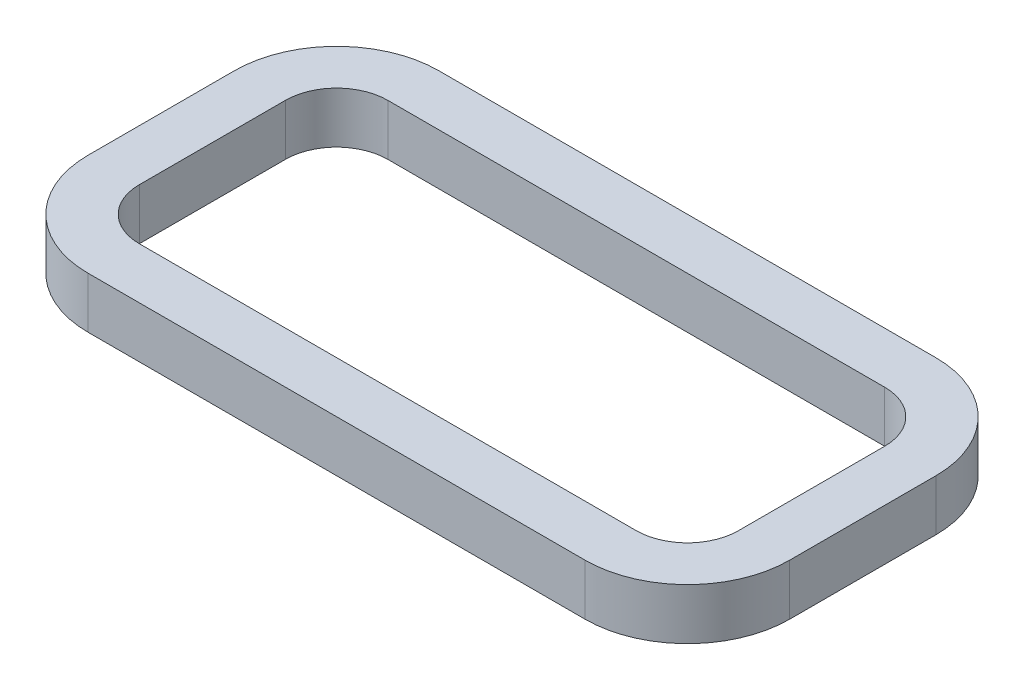
ISO-10303-21;
HEADER;
FILE_DESCRIPTION(('STEP AP214'),'2;1');
FILE_NAME('part.step','',(''),(''),'','','');
FILE_SCHEMA(('AUTOMOTIVE_DESIGN { 1 0 10303 214 1 1 1 1 }'));
ENDSEC;
DATA;
#1=APPLICATION_CONTEXT('core data for automotive mechanical design processes');
#2=APPLICATION_PROTOCOL_DEFINITION('international standard','automotive_design',2000,#1);
#3=PRODUCT_CONTEXT('',#1,'mechanical');
#4=PRODUCT('Part','Part','',(#3));
#5=PRODUCT_RELATED_PRODUCT_CATEGORY('part','',(#4));
#6=PRODUCT_DEFINITION_FORMATION('','',#4);
#7=PRODUCT_DEFINITION_CONTEXT('part definition',#1,'design');
#8=PRODUCT_DEFINITION('design','',#6,#7);
#9=PRODUCT_DEFINITION_SHAPE('','',#8);
#10=(LENGTH_UNIT() NAMED_UNIT(*) SI_UNIT(.MILLI.,.METRE.));
#11=(NAMED_UNIT(*) PLANE_ANGLE_UNIT() SI_UNIT($,.RADIAN.));
#12=(NAMED_UNIT(*) SI_UNIT($,.STERADIAN.) SOLID_ANGLE_UNIT());
#13=UNCERTAINTY_MEASURE_WITH_UNIT(LENGTH_MEASURE(1.E-05),#10,'distance_accuracy_value','');
#14=(GEOMETRIC_REPRESENTATION_CONTEXT(3) GLOBAL_UNCERTAINTY_ASSIGNED_CONTEXT((#13)) GLOBAL_UNIT_ASSIGNED_CONTEXT((#10,
#11,#12)) REPRESENTATION_CONTEXT('',''));
#15=CARTESIAN_POINT('',(0.,0.,0.));
#16=DIRECTION('',(0.,0.,1.));
#17=DIRECTION('',(1.,0.,0.));
#18=AXIS2_PLACEMENT_3D('',#15,#16,#17);
#19=CARTESIAN_POINT('',(107.95,22.225,-31.75));
#20=DIRECTION('',(0.,-1.,0.));
#21=DIRECTION('',(0.,0.,-1.));
#22=AXIS2_PLACEMENT_3D('',#19,#20,#21);
#23=PLANE('',#22);
#24=CARTESIAN_POINT('',(107.95,22.225,-31.75));
#25=DIRECTION('',(0.,-1.,0.));
#26=DIRECTION('',(-1.,0.,0.));
#27=AXIS2_PLACEMENT_3D('',#24,#25,#26);
#28=CIRCLE('',#27,44.45);
#29=CARTESIAN_POINT('',(152.4,22.225,-31.75));
#30=VERTEX_POINT('',#29);
#31=CARTESIAN_POINT('',(107.95,22.225,-76.2));
#32=VERTEX_POINT('',#31);
#33=EDGE_CURVE('E294',#30,#32,#28,.F.);
#34=ORIENTED_EDGE('',*,*,#33,.T.);
#35=DIRECTION('',(-1.,0.,0.));
#36=VECTOR('',#35,1.);
#37=CARTESIAN_POINT('',(107.95,22.225,-76.2));
#38=LINE('',#37,#36);
#39=CARTESIAN_POINT('',(-107.95,22.225,-76.2));
#40=VERTEX_POINT('',#39);
#41=EDGE_CURVE('E298',#32,#40,#38,.T.);
#42=ORIENTED_EDGE('',*,*,#41,.T.);
#43=CARTESIAN_POINT('',(-107.95,22.225,-31.75));
#44=DIRECTION('',(0.,-1.,0.));
#45=DIRECTION('',(-1.,0.,0.));
#46=AXIS2_PLACEMENT_3D('',#43,#44,#45);
#47=CIRCLE('',#46,44.45);
#48=CARTESIAN_POINT('',(-152.4,22.225,-31.75));
#49=VERTEX_POINT('',#48);
#50=EDGE_CURVE('E302',#40,#49,#47,.F.);
#51=ORIENTED_EDGE('',*,*,#50,.T.);
#52=DIRECTION('',(0.,0.,1.));
#53=VECTOR('',#52,1.);
#54=CARTESIAN_POINT('',(-152.4,22.225,-31.7499999999999));
#55=LINE('',#54,#53);
#56=CARTESIAN_POINT('',(-152.4,22.225,31.75));
#57=VERTEX_POINT('',#56);
#58=EDGE_CURVE('E305',#49,#57,#55,.T.);
#59=ORIENTED_EDGE('',*,*,#58,.T.);
#60=CARTESIAN_POINT('',(-107.95,22.225,31.75));
#61=DIRECTION('',(0.,-1.,0.));
#62=DIRECTION('',(-1.,0.,0.));
#63=AXIS2_PLACEMENT_3D('',#60,#61,#62);
#64=CIRCLE('',#63,44.45);
#65=CARTESIAN_POINT('',(-107.95,22.225,76.2));
#66=VERTEX_POINT('',#65);
#67=EDGE_CURVE('E308',#57,#66,#64,.F.);
#68=ORIENTED_EDGE('',*,*,#67,.T.);
#69=DIRECTION('',(1.,0.,0.));
#70=VECTOR('',#69,1.);
#71=CARTESIAN_POINT('',(107.95,22.225,76.2));
#72=LINE('',#71,#70);
#73=CARTESIAN_POINT('',(107.95,22.225,76.2));
#74=VERTEX_POINT('',#73);
#75=EDGE_CURVE('E311',#66,#74,#72,.T.);
#76=ORIENTED_EDGE('',*,*,#75,.T.);
#77=CARTESIAN_POINT('',(107.95,22.225,31.75));
#78=DIRECTION('',(0.,-1.,0.));
#79=DIRECTION('',(-1.,0.,0.));
#80=AXIS2_PLACEMENT_3D('',#77,#78,#79);
#81=CIRCLE('',#80,44.45);
#82=CARTESIAN_POINT('',(152.4,22.225,31.75));
#83=VERTEX_POINT('',#82);
#84=EDGE_CURVE('E314',#74,#83,#81,.F.);
#85=ORIENTED_EDGE('',*,*,#84,.T.);
#86=DIRECTION('',(0.,0.,-1.));
#87=VECTOR('',#86,1.);
#88=CARTESIAN_POINT('',(152.4,22.225,-31.75));
#89=LINE('',#88,#87);
#90=EDGE_CURVE('E317',#83,#30,#89,.T.);
#91=ORIENTED_EDGE('',*,*,#90,.T.);
#92=EDGE_LOOP('',(#34,#42,#51,#59,#68,#76,#85,#91));
#93=FACE_BOUND('',#92,.T.);
#94=CARTESIAN_POINT('',(107.95,22.225,-31.75));
#95=DIRECTION('',(0.,1.,0.));
#96=DIRECTION('',(0.,0.,-1.));
#97=AXIS2_PLACEMENT_3D('',#94,#95,#96);
#98=CIRCLE('',#97,22.225);
#99=CARTESIAN_POINT('',(130.175,22.225,-31.75));
#100=VERTEX_POINT('',#99);
#101=CARTESIAN_POINT('',(107.95,22.225,-53.975));
#102=VERTEX_POINT('',#101);
#103=EDGE_CURVE('E205',#100,#102,#98,.T.);
#104=ORIENTED_EDGE('',*,*,#103,.F.);
#105=DIRECTION('',(0.,0.,-1.));
#106=VECTOR('',#105,1.);
#107=CARTESIAN_POINT('',(130.175,22.225,-31.75));
#108=LINE('',#107,#106);
#109=CARTESIAN_POINT('',(130.175,22.225,31.75));
#110=VERTEX_POINT('',#109);
#111=EDGE_CURVE('E246',#110,#100,#108,.T.);
#112=ORIENTED_EDGE('',*,*,#111,.F.);
#113=CARTESIAN_POINT('',(107.95,22.225,31.75));
#114=DIRECTION('',(0.,1.,0.));
#115=DIRECTION('',(0.,0.,1.));
#116=AXIS2_PLACEMENT_3D('',#113,#114,#115);
#117=CIRCLE('',#116,22.225);
#118=CARTESIAN_POINT('',(107.95,22.225,53.975));
#119=VERTEX_POINT('',#118);
#120=EDGE_CURVE('E243',#119,#110,#117,.T.);
#121=ORIENTED_EDGE('',*,*,#120,.F.);
#122=DIRECTION('',(1.,0.,0.));
#123=VECTOR('',#122,1.);
#124=CARTESIAN_POINT('',(-107.95,22.225,53.975));
#125=LINE('',#124,#123);
#126=CARTESIAN_POINT('',(-107.95,22.225,53.975));
#127=VERTEX_POINT('',#126);
#128=EDGE_CURVE('E240',#127,#119,#125,.T.);
#129=ORIENTED_EDGE('',*,*,#128,.F.);
#130=CARTESIAN_POINT('',(-107.95,22.225,31.75));
#131=DIRECTION('',(0.,1.,0.));
#132=DIRECTION('',(0.,0.,1.));
#133=AXIS2_PLACEMENT_3D('',#130,#131,#132);
#134=CIRCLE('',#133,22.225);
#135=CARTESIAN_POINT('',(-130.175,22.225,31.75));
#136=VERTEX_POINT('',#135);
#137=EDGE_CURVE('E237',#136,#127,#134,.T.);
#138=ORIENTED_EDGE('',*,*,#137,.F.);
#139=DIRECTION('',(0.,0.,1.));
#140=VECTOR('',#139,1.);
#141=CARTESIAN_POINT('',(-130.175,22.225,-31.75));
#142=LINE('',#141,#140);
#143=CARTESIAN_POINT('',(-130.175,22.225,-31.75));
#144=VERTEX_POINT('',#143);
#145=EDGE_CURVE('E232',#144,#136,#142,.T.);
#146=ORIENTED_EDGE('',*,*,#145,.F.);
#147=CARTESIAN_POINT('',(-107.95,22.225,-31.75));
#148=DIRECTION('',(0.,1.,0.));
#149=DIRECTION('',(0.,0.,1.));
#150=AXIS2_PLACEMENT_3D('',#147,#148,#149);
#151=CIRCLE('',#150,22.225);
#152=CARTESIAN_POINT('',(-107.95,22.225,-53.975));
#153=VERTEX_POINT('',#152);
#154=EDGE_CURVE('E228',#153,#144,#151,.T.);
#155=ORIENTED_EDGE('',*,*,#154,.F.);
#156=DIRECTION('',(-1.,0.,0.));
#157=VECTOR('',#156,1.);
#158=CARTESIAN_POINT('',(-107.95,22.225,-53.975));
#159=LINE('',#158,#157);
#160=EDGE_CURVE('E214',#102,#153,#159,.T.);
#161=ORIENTED_EDGE('',*,*,#160,.F.);
#162=EDGE_LOOP('',(#104,#112,#121,#129,#138,#146,#155,#161));
#163=FACE_BOUND('',#162,.T.);
#164=ADVANCED_FACE('F91',(#93,#163),#23,.F.);
#165=CARTESIAN_POINT('',(107.95,0.,-31.75));
#166=DIRECTION('',(0.,-1.,0.));
#167=DIRECTION('',(0.,0.,-1.));
#168=AXIS2_PLACEMENT_3D('',#165,#166,#167);
#169=PLANE('',#168);
#170=CARTESIAN_POINT('',(107.95,0.,-31.75));
#171=DIRECTION('',(0.,-1.,0.));
#172=DIRECTION('',(-1.,0.,0.));
#173=AXIS2_PLACEMENT_3D('',#170,#171,#172);
#174=CIRCLE('',#173,44.45);
#175=CARTESIAN_POINT('',(152.4,0.,-31.75));
#176=VERTEX_POINT('',#175);
#177=CARTESIAN_POINT('',(107.95,0.,-76.2));
#178=VERTEX_POINT('',#177);
#179=EDGE_CURVE('E223',#176,#178,#174,.F.);
#180=ORIENTED_EDGE('',*,*,#179,.F.);
#181=DIRECTION('',(0.,0.,-1.));
#182=VECTOR('',#181,1.);
#183=CARTESIAN_POINT('',(152.4,0.,-31.75));
#184=LINE('',#183,#182);
#185=CARTESIAN_POINT('',(152.4,0.,31.75));
#186=VERTEX_POINT('',#185);
#187=EDGE_CURVE('E299',#186,#176,#184,.T.);
#188=ORIENTED_EDGE('',*,*,#187,.F.);
#189=CARTESIAN_POINT('',(107.95,0.,31.75));
#190=DIRECTION('',(0.,-1.,0.));
#191=DIRECTION('',(-1.,0.,0.));
#192=AXIS2_PLACEMENT_3D('',#189,#190,#191);
#193=CIRCLE('',#192,44.45);
#194=CARTESIAN_POINT('',(107.95,0.,76.2));
#195=VERTEX_POINT('',#194);
#196=EDGE_CURVE('E339',#195,#186,#193,.F.);
#197=ORIENTED_EDGE('',*,*,#196,.F.);
#198=DIRECTION('',(1.,0.,0.));
#199=VECTOR('',#198,1.);
#200=CARTESIAN_POINT('',(107.95,0.,76.2));
#201=LINE('',#200,#199);
#202=CARTESIAN_POINT('',(-107.95,0.,76.2));
#203=VERTEX_POINT('',#202);
#204=EDGE_CURVE('E336',#203,#195,#201,.T.);
#205=ORIENTED_EDGE('',*,*,#204,.F.);
#206=CARTESIAN_POINT('',(-107.95,0.,31.75));
#207=DIRECTION('',(0.,-1.,0.));
#208=DIRECTION('',(-1.,0.,0.));
#209=AXIS2_PLACEMENT_3D('',#206,#207,#208);
#210=CIRCLE('',#209,44.45);
#211=CARTESIAN_POINT('',(-152.4,0.,31.75));
#212=VERTEX_POINT('',#211);
#213=EDGE_CURVE('E333',#212,#203,#210,.F.);
#214=ORIENTED_EDGE('',*,*,#213,.F.);
#215=DIRECTION('',(0.,0.,1.));
#216=VECTOR('',#215,1.);
#217=CARTESIAN_POINT('',(-152.4,0.,-31.7499999999999));
#218=LINE('',#217,#216);
#219=CARTESIAN_POINT('',(-152.4,0.,-31.75));
#220=VERTEX_POINT('',#219);
#221=EDGE_CURVE('E330',#220,#212,#218,.T.);
#222=ORIENTED_EDGE('',*,*,#221,.F.);
#223=CARTESIAN_POINT('',(-107.95,0.,-31.75));
#224=DIRECTION('',(0.,-1.,0.));
#225=DIRECTION('',(-1.,0.,0.));
#226=AXIS2_PLACEMENT_3D('',#223,#224,#225);
#227=CIRCLE('',#226,44.45);
#228=CARTESIAN_POINT('',(-107.95,0.,-76.2));
#229=VERTEX_POINT('',#228);
#230=EDGE_CURVE('E327',#229,#220,#227,.F.);
#231=ORIENTED_EDGE('',*,*,#230,.F.);
#232=DIRECTION('',(-1.,0.,0.));
#233=VECTOR('',#232,1.);
#234=CARTESIAN_POINT('',(107.95,0.,-76.2));
#235=LINE('',#234,#233);
#236=EDGE_CURVE('E324',#178,#229,#235,.T.);
#237=ORIENTED_EDGE('',*,*,#236,.F.);
#238=EDGE_LOOP('',(#180,#188,#197,#205,#214,#222,#231,#237));
#239=FACE_BOUND('',#238,.T.);
#240=DIRECTION('',(0.,0.,-1.));
#241=VECTOR('',#240,1.);
#242=CARTESIAN_POINT('',(130.175,0.,-31.75));
#243=LINE('',#242,#241);
#244=CARTESIAN_POINT('',(130.175,0.,31.75));
#245=VERTEX_POINT('',#244);
#246=CARTESIAN_POINT('',(130.175,0.,-31.75));
#247=VERTEX_POINT('',#246);
#248=EDGE_CURVE('E215',#245,#247,#243,.T.);
#249=ORIENTED_EDGE('',*,*,#248,.T.);
#250=CARTESIAN_POINT('',(107.95,0.,-31.75));
#251=DIRECTION('',(0.,1.,0.));
#252=DIRECTION('',(0.,0.,-1.));
#253=AXIS2_PLACEMENT_3D('',#250,#251,#252);
#254=CIRCLE('',#253,22.225);
#255=CARTESIAN_POINT('',(107.95,0.,-53.975));
#256=VERTEX_POINT('',#255);
#257=EDGE_CURVE('E115',#247,#256,#254,.T.);
#258=ORIENTED_EDGE('',*,*,#257,.T.);
#259=DIRECTION('',(-1.,0.,0.));
#260=VECTOR('',#259,1.);
#261=CARTESIAN_POINT('',(-107.95,0.,-53.975));
#262=LINE('',#261,#260);
#263=CARTESIAN_POINT('',(-107.95,0.,-53.975));
#264=VERTEX_POINT('',#263);
#265=EDGE_CURVE('E221',#256,#264,#262,.T.);
#266=ORIENTED_EDGE('',*,*,#265,.T.);
#267=CARTESIAN_POINT('',(-107.95,0.,-31.75));
#268=DIRECTION('',(0.,1.,0.));
#269=DIRECTION('',(0.,0.,1.));
#270=AXIS2_PLACEMENT_3D('',#267,#268,#269);
#271=CIRCLE('',#270,22.225);
#272=CARTESIAN_POINT('',(-130.175,0.,-31.75));
#273=VERTEX_POINT('',#272);
#274=EDGE_CURVE('E253',#264,#273,#271,.T.);
#275=ORIENTED_EDGE('',*,*,#274,.T.);
#276=DIRECTION('',(0.,0.,1.));
#277=VECTOR('',#276,1.);
#278=CARTESIAN_POINT('',(-130.175,0.,-31.75));
#279=LINE('',#278,#277);
#280=CARTESIAN_POINT('',(-130.175,0.,31.75));
#281=VERTEX_POINT('',#280);
#282=EDGE_CURVE('E257',#273,#281,#279,.T.);
#283=ORIENTED_EDGE('',*,*,#282,.T.);
#284=CARTESIAN_POINT('',(-107.95,0.,31.75));
#285=DIRECTION('',(0.,1.,0.));
#286=DIRECTION('',(0.,0.,1.));
#287=AXIS2_PLACEMENT_3D('',#284,#285,#286);
#288=CIRCLE('',#287,22.225);
#289=CARTESIAN_POINT('',(-107.95,0.,53.975));
#290=VERTEX_POINT('',#289);
#291=EDGE_CURVE('E261',#281,#290,#288,.T.);
#292=ORIENTED_EDGE('',*,*,#291,.T.);
#293=DIRECTION('',(1.,0.,0.));
#294=VECTOR('',#293,1.);
#295=CARTESIAN_POINT('',(-107.95,0.,53.975));
#296=LINE('',#295,#294);
#297=CARTESIAN_POINT('',(107.95,0.,53.975));
#298=VERTEX_POINT('',#297);
#299=EDGE_CURVE('E265',#290,#298,#296,.T.);
#300=ORIENTED_EDGE('',*,*,#299,.T.);
#301=CARTESIAN_POINT('',(107.95,0.,31.75));
#302=DIRECTION('',(0.,1.,0.));
#303=DIRECTION('',(0.,0.,1.));
#304=AXIS2_PLACEMENT_3D('',#301,#302,#303);
#305=CIRCLE('',#304,22.225);
#306=EDGE_CURVE('E269',#298,#245,#305,.T.);
#307=ORIENTED_EDGE('',*,*,#306,.T.);
#308=EDGE_LOOP('',(#249,#258,#266,#275,#283,#292,#300,#307));
#309=FACE_BOUND('',#308,.T.);
#310=ADVANCED_FACE('F378',(#239,#309),#169,.T.);
#311=CARTESIAN_POINT('',(107.95,22.225,-31.75));
#312=DIRECTION('',(0.,-1.,0.));
#313=DIRECTION('',(0.,0.,-1.));
#314=AXIS2_PLACEMENT_3D('',#311,#312,#313);
#315=CYLINDRICAL_SURFACE('',#314,44.45);
#316=ORIENTED_EDGE('',*,*,#179,.T.);
#317=DIRECTION('',(0.,-1.,0.));
#318=VECTOR('',#317,1.);
#319=CARTESIAN_POINT('',(107.95,22.225,-76.2));
#320=LINE('',#319,#318);
#321=EDGE_CURVE('E12',#32,#178,#320,.T.);
#322=ORIENTED_EDGE('',*,*,#321,.F.);
#323=ORIENTED_EDGE('',*,*,#33,.F.);
#324=DIRECTION('',(0.,-1.,0.));
#325=VECTOR('',#324,1.);
#326=CARTESIAN_POINT('',(152.4,22.225,-31.75));
#327=LINE('',#326,#325);
#328=EDGE_CURVE('E320',#30,#176,#327,.T.);
#329=ORIENTED_EDGE('',*,*,#328,.T.);
#330=EDGE_LOOP('',(#316,#322,#323,#329));
#331=FACE_BOUND('',#330,.T.);
#332=ADVANCED_FACE('F93',(#331),#315,.T.);
#333=CARTESIAN_POINT('',(107.95,22.225,-76.2));
#334=DIRECTION('',(0.,0.,1.));
#335=DIRECTION('',(1.,0.,0.));
#336=AXIS2_PLACEMENT_3D('',#333,#334,#335);
#337=PLANE('',#336);
#338=ORIENTED_EDGE('',*,*,#236,.T.);
#339=DIRECTION('',(0.,-1.,0.));
#340=VECTOR('',#339,1.);
#341=CARTESIAN_POINT('',(-107.95,22.225,-76.2));
#342=LINE('',#341,#340);
#343=EDGE_CURVE('E100',#40,#229,#342,.T.);
#344=ORIENTED_EDGE('',*,*,#343,.F.);
#345=ORIENTED_EDGE('',*,*,#41,.F.);
#346=ORIENTED_EDGE('',*,*,#321,.T.);
#347=EDGE_LOOP('',(#338,#344,#345,#346));
#348=FACE_BOUND('',#347,.T.);
#349=ADVANCED_FACE('F395',(#348),#337,.F.);
#350=CARTESIAN_POINT('',(-107.95,22.225,-31.75));
#351=DIRECTION('',(0.,-1.,0.));
#352=DIRECTION('',(0.,0.,-1.));
#353=AXIS2_PLACEMENT_3D('',#350,#351,#352);
#354=CYLINDRICAL_SURFACE('',#353,44.45);
#355=ORIENTED_EDGE('',*,*,#230,.T.);
#356=DIRECTION('',(0.,-1.,0.));
#357=VECTOR('',#356,1.);
#358=CARTESIAN_POINT('',(-152.4,22.225,-31.75));
#359=LINE('',#358,#357);
#360=EDGE_CURVE('E363',#49,#220,#359,.T.);
#361=ORIENTED_EDGE('',*,*,#360,.F.);
#362=ORIENTED_EDGE('',*,*,#50,.F.);
#363=ORIENTED_EDGE('',*,*,#343,.T.);
#364=EDGE_LOOP('',(#355,#361,#362,#363));
#365=FACE_BOUND('',#364,.T.);
#366=ADVANCED_FACE('F372',(#365),#354,.T.);
#367=CARTESIAN_POINT('',(-152.4,22.225,-31.7499999999999));
#368=DIRECTION('',(1.,0.,0.));
#369=DIRECTION('',(0.,0.,-1.));
#370=AXIS2_PLACEMENT_3D('',#367,#368,#369);
#371=PLANE('',#370);
#372=ORIENTED_EDGE('',*,*,#221,.T.);
#373=DIRECTION('',(0.,-1.,0.));
#374=VECTOR('',#373,1.);
#375=CARTESIAN_POINT('',(-152.4,22.225,31.75));
#376=LINE('',#375,#374);
#377=EDGE_CURVE('E359',#57,#212,#376,.T.);
#378=ORIENTED_EDGE('',*,*,#377,.F.);
#379=ORIENTED_EDGE('',*,*,#58,.F.);
#380=ORIENTED_EDGE('',*,*,#360,.T.);
#381=EDGE_LOOP('',(#372,#378,#379,#380));
#382=FACE_BOUND('',#381,.T.);
#383=ADVANCED_FACE('F384',(#382),#371,.F.);
#384=CARTESIAN_POINT('',(-107.95,22.225,31.75));
#385=DIRECTION('',(0.,-1.,0.));
#386=DIRECTION('',(0.,0.,-1.));
#387=AXIS2_PLACEMENT_3D('',#384,#385,#386);
#388=CYLINDRICAL_SURFACE('',#387,44.45);
#389=ORIENTED_EDGE('',*,*,#213,.T.);
#390=DIRECTION('',(0.,-1.,0.));
#391=VECTOR('',#390,1.);
#392=CARTESIAN_POINT('',(-107.95,22.225,76.2));
#393=LINE('',#392,#391);
#394=EDGE_CURVE('E355',#66,#203,#393,.T.);
#395=ORIENTED_EDGE('',*,*,#394,.F.);
#396=ORIENTED_EDGE('',*,*,#67,.F.);
#397=ORIENTED_EDGE('',*,*,#377,.T.);
#398=EDGE_LOOP('',(#389,#395,#396,#397));
#399=FACE_BOUND('',#398,.T.);
#400=ADVANCED_FACE('F388',(#399),#388,.T.);
#401=CARTESIAN_POINT('',(107.95,22.225,76.2));
#402=DIRECTION('',(0.,0.,-1.));
#403=DIRECTION('',(-1.,0.,0.));
#404=AXIS2_PLACEMENT_3D('',#401,#402,#403);
#405=PLANE('',#404);
#406=ORIENTED_EDGE('',*,*,#204,.T.);
#407=DIRECTION('',(0.,-1.,0.));
#408=VECTOR('',#407,1.);
#409=CARTESIAN_POINT('',(107.95,22.225,76.2));
#410=LINE('',#409,#408);
#411=EDGE_CURVE('E351',#74,#195,#410,.T.);
#412=ORIENTED_EDGE('',*,*,#411,.F.);
#413=ORIENTED_EDGE('',*,*,#75,.F.);
#414=ORIENTED_EDGE('',*,*,#394,.T.);
#415=EDGE_LOOP('',(#406,#412,#413,#414));
#416=FACE_BOUND('',#415,.T.);
#417=ADVANCED_FACE('F408',(#416),#405,.F.);
#418=CARTESIAN_POINT('',(107.95,22.225,31.75));
#419=DIRECTION('',(0.,-1.,0.));
#420=DIRECTION('',(0.,0.,-1.));
#421=AXIS2_PLACEMENT_3D('',#418,#419,#420);
#422=CYLINDRICAL_SURFACE('',#421,44.45);
#423=ORIENTED_EDGE('',*,*,#196,.T.);
#424=DIRECTION('',(0.,-1.,0.));
#425=VECTOR('',#424,1.);
#426=CARTESIAN_POINT('',(152.4,22.225,31.75));
#427=LINE('',#426,#425);
#428=EDGE_CURVE('E347',#83,#186,#427,.T.);
#429=ORIENTED_EDGE('',*,*,#428,.F.);
#430=ORIENTED_EDGE('',*,*,#84,.F.);
#431=ORIENTED_EDGE('',*,*,#411,.T.);
#432=EDGE_LOOP('',(#423,#429,#430,#431));
#433=FACE_BOUND('',#432,.T.);
#434=ADVANCED_FACE('F406',(#433),#422,.T.);
#435=CARTESIAN_POINT('',(152.4,22.225,-31.75));
#436=DIRECTION('',(-1.,0.,0.));
#437=DIRECTION('',(0.,0.,1.));
#438=AXIS2_PLACEMENT_3D('',#435,#436,#437);
#439=PLANE('',#438);
#440=ORIENTED_EDGE('',*,*,#187,.T.);
#441=ORIENTED_EDGE('',*,*,#328,.F.);
#442=ORIENTED_EDGE('',*,*,#90,.F.);
#443=ORIENTED_EDGE('',*,*,#428,.T.);
#444=EDGE_LOOP('',(#440,#441,#442,#443));
#445=FACE_BOUND('',#444,.T.);
#446=ADVANCED_FACE('F401',(#445),#439,.F.);
#447=CARTESIAN_POINT('',(107.95,22.225,-31.75));
#448=DIRECTION('',(0.,-1.,0.));
#449=DIRECTION('',(0.,0.,-1.));
#450=AXIS2_PLACEMENT_3D('',#447,#448,#449);
#451=CYLINDRICAL_SURFACE('',#450,22.225);
#452=ORIENTED_EDGE('',*,*,#257,.F.);
#453=DIRECTION('',(0.,-1.,0.));
#454=VECTOR('',#453,1.);
#455=CARTESIAN_POINT('',(130.175,22.225,-31.75));
#456=LINE('',#455,#454);
#457=EDGE_CURVE('E209',#100,#247,#456,.T.);
#458=ORIENTED_EDGE('',*,*,#457,.F.);
#459=ORIENTED_EDGE('',*,*,#103,.T.);
#460=DIRECTION('',(0.,-1.,0.));
#461=VECTOR('',#460,1.);
#462=CARTESIAN_POINT('',(107.95,22.225,-53.975));
#463=LINE('',#462,#461);
#464=EDGE_CURVE('E208',#102,#256,#463,.T.);
#465=ORIENTED_EDGE('',*,*,#464,.T.);
#466=EDGE_LOOP('',(#452,#458,#459,#465));
#467=FACE_BOUND('',#466,.T.);
#468=ADVANCED_FACE('F207',(#467),#451,.F.);
#469=CARTESIAN_POINT('',(-107.95,22.225,-53.975));
#470=DIRECTION('',(0.,0.,1.));
#471=DIRECTION('',(1.,0.,0.));
#472=AXIS2_PLACEMENT_3D('',#469,#470,#471);
#473=PLANE('',#472);
#474=ORIENTED_EDGE('',*,*,#265,.F.);
#475=ORIENTED_EDGE('',*,*,#464,.F.);
#476=ORIENTED_EDGE('',*,*,#160,.T.);
#477=DIRECTION('',(0.,-1.,0.));
#478=VECTOR('',#477,1.);
#479=CARTESIAN_POINT('',(-107.95,22.225,-53.975));
#480=LINE('',#479,#478);
#481=EDGE_CURVE('E224',#153,#264,#480,.T.);
#482=ORIENTED_EDGE('',*,*,#481,.T.);
#483=EDGE_LOOP('',(#474,#475,#476,#482));
#484=FACE_BOUND('',#483,.T.);
#485=ADVANCED_FACE('F218',(#484),#473,.T.);
#486=CARTESIAN_POINT('',(-107.95,22.225,-31.75));
#487=DIRECTION('',(0.,-1.,0.));
#488=DIRECTION('',(0.,0.,-1.));
#489=AXIS2_PLACEMENT_3D('',#486,#487,#488);
#490=CYLINDRICAL_SURFACE('',#489,22.225);
#491=ORIENTED_EDGE('',*,*,#274,.F.);
#492=ORIENTED_EDGE('',*,*,#481,.F.);
#493=ORIENTED_EDGE('',*,*,#154,.T.);
#494=DIRECTION('',(0.,-1.,0.));
#495=VECTOR('',#494,1.);
#496=CARTESIAN_POINT('',(-130.175,22.225,-31.75));
#497=LINE('',#496,#495);
#498=EDGE_CURVE('E289',#144,#273,#497,.T.);
#499=ORIENTED_EDGE('',*,*,#498,.T.);
#500=EDGE_LOOP('',(#491,#492,#493,#499));
#501=FACE_BOUND('',#500,.T.);
#502=ADVANCED_FACE('F433',(#501),#490,.F.);
#503=CARTESIAN_POINT('',(-130.175,22.225,-31.75));
#504=DIRECTION('',(1.,0.,0.));
#505=DIRECTION('',(0.,0.,-1.));
#506=AXIS2_PLACEMENT_3D('',#503,#504,#505);
#507=PLANE('',#506);
#508=ORIENTED_EDGE('',*,*,#282,.F.);
#509=ORIENTED_EDGE('',*,*,#498,.F.);
#510=ORIENTED_EDGE('',*,*,#145,.T.);
#511=DIRECTION('',(0.,-1.,0.));
#512=VECTOR('',#511,1.);
#513=CARTESIAN_POINT('',(-130.175,22.225,31.75));
#514=LINE('',#513,#512);
#515=EDGE_CURVE('E286',#136,#281,#514,.T.);
#516=ORIENTED_EDGE('',*,*,#515,.T.);
#517=EDGE_LOOP('',(#508,#509,#510,#516));
#518=FACE_BOUND('',#517,.T.);
#519=ADVANCED_FACE('F437',(#518),#507,.T.);
#520=CARTESIAN_POINT('',(-107.95,22.225,31.75));
#521=DIRECTION('',(0.,-1.,0.));
#522=DIRECTION('',(0.,0.,-1.));
#523=AXIS2_PLACEMENT_3D('',#520,#521,#522);
#524=CYLINDRICAL_SURFACE('',#523,22.225);
#525=ORIENTED_EDGE('',*,*,#291,.F.);
#526=ORIENTED_EDGE('',*,*,#515,.F.);
#527=ORIENTED_EDGE('',*,*,#137,.T.);
#528=DIRECTION('',(0.,-1.,0.));
#529=VECTOR('',#528,1.);
#530=CARTESIAN_POINT('',(-107.95,22.225,53.975));
#531=LINE('',#530,#529);
#532=EDGE_CURVE('E283',#127,#290,#531,.T.);
#533=ORIENTED_EDGE('',*,*,#532,.T.);
#534=EDGE_LOOP('',(#525,#526,#527,#533));
#535=FACE_BOUND('',#534,.T.);
#536=ADVANCED_FACE('F443',(#535),#524,.F.);
#537=CARTESIAN_POINT('',(-107.95,22.225,53.975));
#538=DIRECTION('',(0.,0.,-1.));
#539=DIRECTION('',(-1.,0.,0.));
#540=AXIS2_PLACEMENT_3D('',#537,#538,#539);
#541=PLANE('',#540);
#542=ORIENTED_EDGE('',*,*,#299,.F.);
#543=ORIENTED_EDGE('',*,*,#532,.F.);
#544=ORIENTED_EDGE('',*,*,#128,.T.);
#545=DIRECTION('',(0.,-1.,0.));
#546=VECTOR('',#545,1.);
#547=CARTESIAN_POINT('',(107.95,22.225,53.975));
#548=LINE('',#547,#546);
#549=EDGE_CURVE('E280',#119,#298,#548,.T.);
#550=ORIENTED_EDGE('',*,*,#549,.T.);
#551=EDGE_LOOP('',(#542,#543,#544,#550));
#552=FACE_BOUND('',#551,.T.);
#553=ADVANCED_FACE('F447',(#552),#541,.T.);
#554=CARTESIAN_POINT('',(107.95,22.225,31.75));
#555=DIRECTION('',(0.,-1.,0.));
#556=DIRECTION('',(0.,0.,-1.));
#557=AXIS2_PLACEMENT_3D('',#554,#555,#556);
#558=CYLINDRICAL_SURFACE('',#557,22.225);
#559=ORIENTED_EDGE('',*,*,#306,.F.);
#560=ORIENTED_EDGE('',*,*,#549,.F.);
#561=ORIENTED_EDGE('',*,*,#120,.T.);
#562=DIRECTION('',(0.,-1.,0.));
#563=VECTOR('',#562,1.);
#564=CARTESIAN_POINT('',(130.175,22.225,31.75));
#565=LINE('',#564,#563);
#566=EDGE_CURVE('E107',#110,#245,#565,.T.);
#567=ORIENTED_EDGE('',*,*,#566,.T.);
#568=EDGE_LOOP('',(#559,#560,#561,#567));
#569=FACE_BOUND('',#568,.T.);
#570=ADVANCED_FACE('F451',(#569),#558,.F.);
#571=CARTESIAN_POINT('',(130.175,22.225,-31.75));
#572=DIRECTION('',(-1.,0.,0.));
#573=DIRECTION('',(0.,0.,1.));
#574=AXIS2_PLACEMENT_3D('',#571,#572,#573);
#575=PLANE('',#574);
#576=ORIENTED_EDGE('',*,*,#248,.F.);
#577=ORIENTED_EDGE('',*,*,#566,.F.);
#578=ORIENTED_EDGE('',*,*,#111,.T.);
#579=ORIENTED_EDGE('',*,*,#457,.T.);
#580=EDGE_LOOP('',(#576,#577,#578,#579));
#581=FACE_BOUND('',#580,.T.);
#582=ADVANCED_FACE('F455',(#581),#575,.T.);
#583=CLOSED_SHELL('',(#164,#310,#332,#349,#366,#383,#400,#417,#434,#446,#468,#485,#502,#519,
#536,#553,#570,#582));
#584=MANIFOLD_SOLID_BREP('B2',#583);
#585=ADVANCED_BREP_SHAPE_REPRESENTATION('',(#18,#584),#14);
#586=SHAPE_DEFINITION_REPRESENTATION(#9,#585);
ENDSEC;
END-ISO-10303-21;
